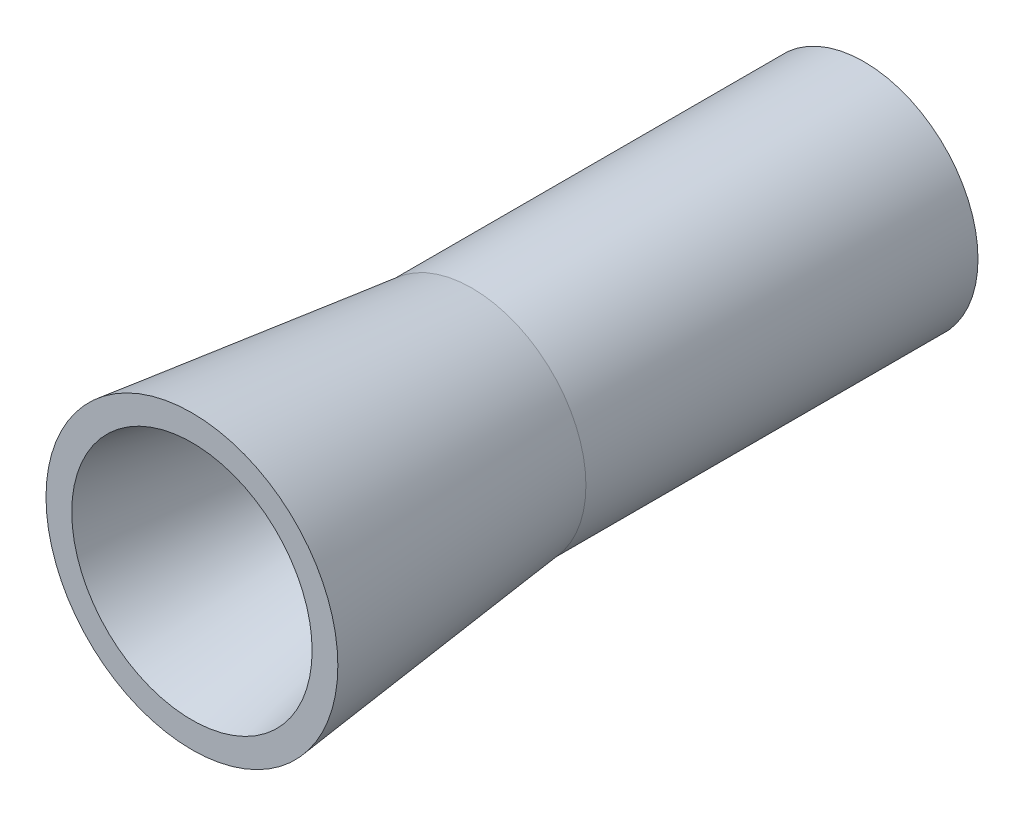
ISO-10303-21;
HEADER;
FILE_DESCRIPTION(('STEP AP214'),'2;1');
FILE_NAME('part.step','',(''),(''),'','','');
FILE_SCHEMA(('AUTOMOTIVE_DESIGN { 1 0 10303 214 1 1 1 1 }'));
ENDSEC;
DATA;
#1=APPLICATION_CONTEXT('core data for automotive mechanical design processes');
#2=APPLICATION_PROTOCOL_DEFINITION('international standard','automotive_design',2000,#1);
#3=PRODUCT_CONTEXT('',#1,'mechanical');
#4=PRODUCT('Part','Part','',(#3));
#5=PRODUCT_RELATED_PRODUCT_CATEGORY('part','',(#4));
#6=PRODUCT_DEFINITION_FORMATION('','',#4);
#7=PRODUCT_DEFINITION_CONTEXT('part definition',#1,'design');
#8=PRODUCT_DEFINITION('design','',#6,#7);
#9=PRODUCT_DEFINITION_SHAPE('','',#8);
#10=(LENGTH_UNIT() NAMED_UNIT(*) SI_UNIT(.MILLI.,.METRE.));
#11=(NAMED_UNIT(*) PLANE_ANGLE_UNIT() SI_UNIT($,.RADIAN.));
#12=(NAMED_UNIT(*) SI_UNIT($,.STERADIAN.) SOLID_ANGLE_UNIT());
#13=UNCERTAINTY_MEASURE_WITH_UNIT(LENGTH_MEASURE(1.E-05),#10,'distance_accuracy_value','');
#14=(GEOMETRIC_REPRESENTATION_CONTEXT(3) GLOBAL_UNCERTAINTY_ASSIGNED_CONTEXT((#13)) GLOBAL_UNIT_ASSIGNED_CONTEXT((#10,
#11,#12)) REPRESENTATION_CONTEXT('',''));
#15=CARTESIAN_POINT('',(0.,0.,0.));
#16=DIRECTION('',(0.,0.,1.));
#17=DIRECTION('',(1.,0.,0.));
#18=AXIS2_PLACEMENT_3D('',#15,#16,#17);
#19=CARTESIAN_POINT('',(0.,257.561673270768,-1222.96720024889));
#20=DIRECTION('',(0.,0.,1.));
#21=DIRECTION('',(1.,0.,0.));
#22=AXIS2_PLACEMENT_3D('',#19,#20,#21);
#23=CONICAL_SURFACE('',#22,109.292957609086,0.113808991374198);
#24=CARTESIAN_POINT('',(0.,257.561673270768,-954.248849632067));
#25=DIRECTION('',(0.,0.,-1.));
#26=DIRECTION('',(-1.,0.,0.));
#27=AXIS2_PLACEMENT_3D('',#24,#25,#26);
#28=CIRCLE('',#27,140.008249845482);
#29=CARTESIAN_POINT('',(-140.008249845482,257.561673270768,-954.248849632067));
#30=VERTEX_POINT('',#29);
#31=EDGE_CURVE('E10',#30,#30,#28,.T.);
#32=ORIENTED_EDGE('',*,*,#31,.T.);
#33=EDGE_LOOP('',(#32));
#34=FACE_BOUND('',#33,.T.);
#35=CARTESIAN_POINT('',(0.,257.561673270768,-1222.96720024889));
#36=DIRECTION('',(0.,0.,-1.));
#37=DIRECTION('',(-1.,0.,0.));
#38=AXIS2_PLACEMENT_3D('',#35,#36,#37);
#39=CIRCLE('',#38,109.292957609086);
#40=CARTESIAN_POINT('',(-109.292957609086,257.561673270768,-1222.96720024889));
#41=VERTEX_POINT('',#40);
#42=EDGE_CURVE('E60',#41,#41,#39,.T.);
#43=ORIENTED_EDGE('',*,*,#42,.F.);
#44=EDGE_LOOP('',(#43));
#45=FACE_BOUND('',#44,.T.);
#46=ADVANCED_FACE('F35',(#34,#45),#23,.T.);
#47=CARTESIAN_POINT('',(0.,397.56992311625,-954.248849632067));
#48=DIRECTION('',(0.,0.,1.));
#49=DIRECTION('',(1.,0.,0.));
#50=AXIS2_PLACEMENT_3D('',#47,#48,#49);
#51=PLANE('',#50);
#52=CARTESIAN_POINT('',(0.,257.561673270768,-954.248849632067));
#53=DIRECTION('',(0.,0.,-1.));
#54=DIRECTION('',(-1.,0.,0.));
#55=AXIS2_PLACEMENT_3D('',#52,#53,#54);
#56=CIRCLE('',#55,115.309498812371);
#57=CARTESIAN_POINT('',(-115.309498812371,257.561673270768,-954.248849632067));
#58=VERTEX_POINT('',#57);
#59=EDGE_CURVE('E41',#58,#58,#56,.T.);
#60=ORIENTED_EDGE('',*,*,#59,.T.);
#61=EDGE_LOOP('',(#60));
#62=FACE_BOUND('',#61,.T.);
#63=ORIENTED_EDGE('',*,*,#31,.F.);
#64=EDGE_LOOP('',(#63));
#65=FACE_BOUND('',#64,.T.);
#66=ADVANCED_FACE('F68',(#62,#65),#51,.T.);
#67=CARTESIAN_POINT('',(0.,257.561673270768,-954.248849632067));
#68=DIRECTION('',(0.,0.,1.));
#69=DIRECTION('',(1.,0.,0.));
#70=AXIS2_PLACEMENT_3D('',#67,#68,#69);
#71=CONICAL_SURFACE('',#70,115.309498812371,0.208399242263438);
#72=CARTESIAN_POINT('',(0.,257.561673270768,-1200.354261712));
#73=DIRECTION('',(0.,0.,-1.));
#74=DIRECTION('',(-1.,0.,0.));
#75=AXIS2_PLACEMENT_3D('',#72,#73,#74);
#76=CIRCLE('',#75,63.2657019926005);
#77=CARTESIAN_POINT('',(-63.2657019926005,257.561673270768,-1200.354261712));
#78=VERTEX_POINT('',#77);
#79=EDGE_CURVE('E45',#78,#78,#76,.T.);
#80=ORIENTED_EDGE('',*,*,#79,.T.);
#81=EDGE_LOOP('',(#80));
#82=FACE_BOUND('',#81,.T.);
#83=ORIENTED_EDGE('',*,*,#59,.F.);
#84=EDGE_LOOP('',(#83));
#85=FACE_BOUND('',#84,.T.);
#86=ADVANCED_FACE('F72',(#82,#85),#71,.F.);
#87=CARTESIAN_POINT('',(0.,257.561673270768,-1614.3054160914));
#88=DIRECTION('',(0.,0.,-1.));
#89=DIRECTION('',(-1.,0.,0.));
#90=AXIS2_PLACEMENT_3D('',#87,#88,#89);
#91=CYLINDRICAL_SURFACE('',#90,63.2657019926005);
#92=CARTESIAN_POINT('',(0.,257.561673270768,-1453.24665134034));
#93=DIRECTION('',(0.,0.,-1.));
#94=DIRECTION('',(-1.,0.,0.));
#95=AXIS2_PLACEMENT_3D('',#92,#93,#94);
#96=CIRCLE('',#95,63.2657019926005);
#97=CARTESIAN_POINT('',(-63.2657019926005,257.561673270768,-1453.24665134034));
#98=VERTEX_POINT('',#97);
#99=EDGE_CURVE('E49',#98,#98,#96,.T.);
#100=ORIENTED_EDGE('',*,*,#99,.T.);
#101=EDGE_LOOP('',(#100));
#102=FACE_BOUND('',#101,.T.);
#103=ORIENTED_EDGE('',*,*,#79,.F.);
#104=EDGE_LOOP('',(#103));
#105=FACE_BOUND('',#104,.T.);
#106=ADVANCED_FACE('F76',(#102,#105),#91,.F.);
#107=CARTESIAN_POINT('',(0.,257.561673270768,-1453.24665134034));
#108=DIRECTION('',(0.,0.,-1.));
#109=DIRECTION('',(-1.,0.,0.));
#110=AXIS2_PLACEMENT_3D('',#107,#108,#109);
#111=CONICAL_SURFACE('',#110,63.2657019926005,0.10846723662732);
#112=CARTESIAN_POINT('',(0.,257.561673270768,-1599.13049208413));
#113=DIRECTION('',(0.,0.,-1.));
#114=DIRECTION('',(-1.,0.,0.));
#115=AXIS2_PLACEMENT_3D('',#112,#113,#114);
#116=CIRCLE('',#115,79.1516681992109);
#117=CARTESIAN_POINT('',(-79.1516681992109,257.561673270768,-1599.13049208413));
#118=VERTEX_POINT('',#117);
#119=EDGE_CURVE('E54',#118,#118,#116,.T.);
#120=ORIENTED_EDGE('',*,*,#119,.T.);
#121=EDGE_LOOP('',(#120));
#122=FACE_BOUND('',#121,.T.);
#123=ORIENTED_EDGE('',*,*,#99,.F.);
#124=EDGE_LOOP('',(#123));
#125=FACE_BOUND('',#124,.T.);
#126=ADVANCED_FACE('F83',(#122,#125),#111,.F.);
#127=CARTESIAN_POINT('',(0.,336.713341469979,-1599.13049208413));
#128=DIRECTION('',(0.,0.,-1.));
#129=DIRECTION('',(-1.,0.,0.));
#130=AXIS2_PLACEMENT_3D('',#127,#128,#129);
#131=PLANE('',#130);
#132=CARTESIAN_POINT('',(0.,257.561673270768,-1599.13049208413));
#133=DIRECTION('',(0.,0.,-1.));
#134=DIRECTION('',(-1.,0.,0.));
#135=AXIS2_PLACEMENT_3D('',#132,#133,#134);
#136=CIRCLE('',#135,109.292957609086);
#137=CARTESIAN_POINT('',(-109.292957609086,257.561673270768,-1599.13049208413));
#138=VERTEX_POINT('',#137);
#139=EDGE_CURVE('E57',#138,#138,#136,.T.);
#140=ORIENTED_EDGE('',*,*,#139,.T.);
#141=EDGE_LOOP('',(#140));
#142=FACE_BOUND('',#141,.T.);
#143=ORIENTED_EDGE('',*,*,#119,.F.);
#144=EDGE_LOOP('',(#143));
#145=FACE_BOUND('',#144,.T.);
#146=ADVANCED_FACE('F87',(#142,#145),#131,.T.);
#147=CARTESIAN_POINT('',(0.,257.561673270768,-1614.3054160914));
#148=DIRECTION('',(0.,0.,-1.));
#149=DIRECTION('',(-1.,0.,0.));
#150=AXIS2_PLACEMENT_3D('',#147,#148,#149);
#151=CYLINDRICAL_SURFACE('',#150,109.292957609086);
#152=ORIENTED_EDGE('',*,*,#42,.T.);
#153=EDGE_LOOP('',(#152));
#154=FACE_BOUND('',#153,.T.);
#155=ORIENTED_EDGE('',*,*,#139,.F.);
#156=EDGE_LOOP('',(#155));
#157=FACE_BOUND('',#156,.T.);
#158=ADVANCED_FACE('F64',(#154,#157),#151,.T.);
#159=CLOSED_SHELL('',(#46,#66,#86,#106,#126,#146,#158));
#160=MANIFOLD_SOLID_BREP('B2',#159);
#161=ADVANCED_BREP_SHAPE_REPRESENTATION('',(#18,#160),#14);
#162=SHAPE_DEFINITION_REPRESENTATION(#9,#161);
ENDSEC;
END-ISO-10303-21;
